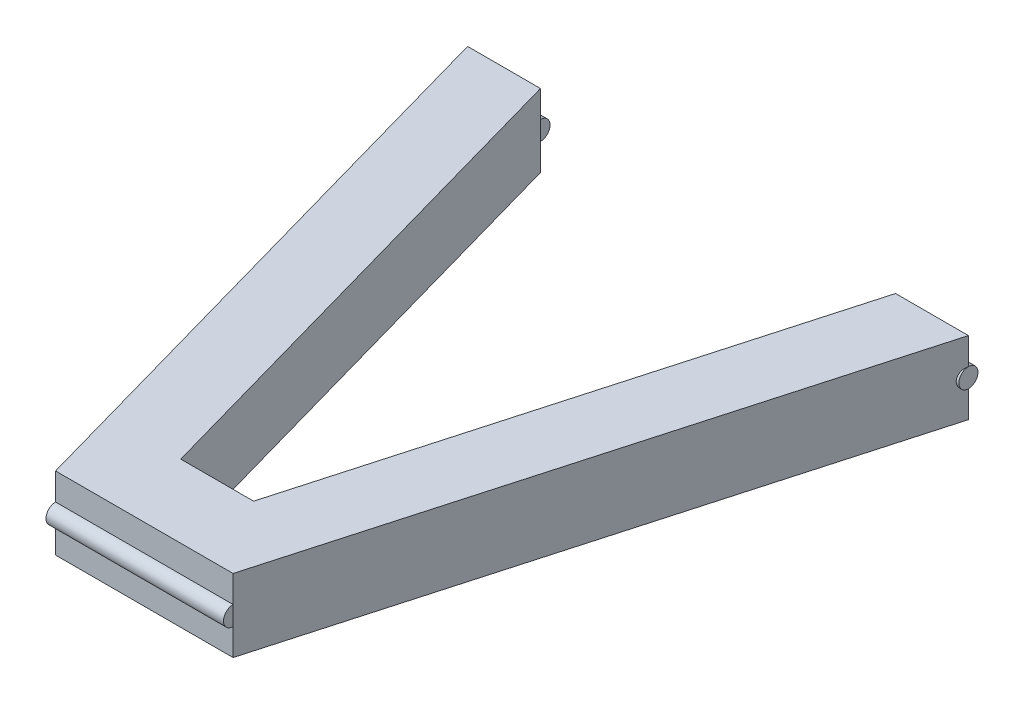
ISO-10303-21;
HEADER;
FILE_DESCRIPTION(('STEP AP214'),'2;1');
FILE_NAME('part.step','',(''),(''),'','','');
FILE_SCHEMA(('AUTOMOTIVE_DESIGN { 1 0 10303 214 1 1 1 1 }'));
ENDSEC;
DATA;
#1=APPLICATION_CONTEXT('core data for automotive mechanical design processes');
#2=APPLICATION_PROTOCOL_DEFINITION('international standard','automotive_design',2000,#1);
#3=PRODUCT_CONTEXT('',#1,'mechanical');
#4=PRODUCT('Part','Part','',(#3));
#5=PRODUCT_RELATED_PRODUCT_CATEGORY('part','',(#4));
#6=PRODUCT_DEFINITION_FORMATION('','',#4);
#7=PRODUCT_DEFINITION_CONTEXT('part definition',#1,'design');
#8=PRODUCT_DEFINITION('design','',#6,#7);
#9=PRODUCT_DEFINITION_SHAPE('','',#8);
#10=(LENGTH_UNIT() NAMED_UNIT(*) SI_UNIT(.MILLI.,.METRE.));
#11=(NAMED_UNIT(*) PLANE_ANGLE_UNIT() SI_UNIT($,.RADIAN.));
#12=(NAMED_UNIT(*) SI_UNIT($,.STERADIAN.) SOLID_ANGLE_UNIT());
#13=UNCERTAINTY_MEASURE_WITH_UNIT(LENGTH_MEASURE(1.E-05),#10,'distance_accuracy_value','');
#14=(GEOMETRIC_REPRESENTATION_CONTEXT(3) GLOBAL_UNCERTAINTY_ASSIGNED_CONTEXT((#13)) GLOBAL_UNIT_ASSIGNED_CONTEXT((#10,
#11,#12)) REPRESENTATION_CONTEXT('',''));
#15=CARTESIAN_POINT('',(0.,0.,0.));
#16=DIRECTION('',(0.,0.,1.));
#17=DIRECTION('',(1.,0.,0.));
#18=AXIS2_PLACEMENT_3D('',#15,#16,#17);
#19=CARTESIAN_POINT('',(261.9,38.1,-300.));
#20=DIRECTION('',(0.,0.,1.));
#21=DIRECTION('',(1.,0.,0.));
#22=AXIS2_PLACEMENT_3D('',#19,#20,#21);
#23=PLANE('',#22);
#24=DIRECTION('',(0.,-1.,0.));
#25=VECTOR('',#24,1.);
#26=CARTESIAN_POINT('',(261.9,38.1,-300.));
#27=LINE('',#26,#25);
#28=CARTESIAN_POINT('',(261.9,38.1,-300.));
#29=VERTEX_POINT('',#28);
#30=CARTESIAN_POINT('',(261.9,24.05,-300.));
#31=VERTEX_POINT('',#30);
#32=EDGE_CURVE('E257',#29,#31,#27,.T.);
#33=ORIENTED_EDGE('',*,*,#32,.T.);
#34=DIRECTION('',(-1.,0.,0.));
#35=VECTOR('',#34,1.);
#36=CARTESIAN_POINT('',(261.9,24.05,-300.));
#37=LINE('',#36,#35);
#38=CARTESIAN_POINT('',(223.8,24.05,-300.));
#39=VERTEX_POINT('',#38);
#40=EDGE_CURVE('E246',#31,#39,#37,.T.);
#41=ORIENTED_EDGE('',*,*,#40,.T.);
#42=DIRECTION('',(0.,-1.,0.));
#43=VECTOR('',#42,1.);
#44=CARTESIAN_POINT('',(223.8,38.1,-300.));
#45=LINE('',#44,#43);
#46=CARTESIAN_POINT('',(223.8,38.1,-300.));
#47=VERTEX_POINT('',#46);
#48=EDGE_CURVE('E239',#47,#39,#45,.T.);
#49=ORIENTED_EDGE('',*,*,#48,.F.);
#50=DIRECTION('',(-1.,0.,0.));
#51=VECTOR('',#50,1.);
#52=CARTESIAN_POINT('',(261.9,38.1,-300.));
#53=LINE('',#52,#51);
#54=EDGE_CURVE('E315',#29,#47,#53,.T.);
#55=ORIENTED_EDGE('',*,*,#54,.F.);
#56=EDGE_LOOP('',(#33,#41,#49,#55));
#57=FACE_BOUND('',#56,.T.);
#58=ADVANCED_FACE('F59',(#57),#23,.F.);
#59=CARTESIAN_POINT('',(38.1,38.1,-300.));
#60=DIRECTION('',(0.,0.,1.));
#61=DIRECTION('',(1.,0.,0.));
#62=AXIS2_PLACEMENT_3D('',#59,#60,#61);
#63=PLANE('',#62);
#64=DIRECTION('',(0.,-1.,0.));
#65=VECTOR('',#64,1.);
#66=CARTESIAN_POINT('',(0.,38.1,-300.));
#67=LINE('',#66,#65);
#68=CARTESIAN_POINT('',(0.,14.05,-300.));
#69=VERTEX_POINT('',#68);
#70=CARTESIAN_POINT('',(0.,0.,-300.));
#71=VERTEX_POINT('',#70);
#72=EDGE_CURVE('E295',#69,#71,#67,.T.);
#73=ORIENTED_EDGE('',*,*,#72,.F.);
#74=DIRECTION('',(1.,0.,0.));
#75=VECTOR('',#74,1.);
#76=CARTESIAN_POINT('',(0.,14.05,-300.));
#77=LINE('',#76,#75);
#78=CARTESIAN_POINT('',(38.1,14.05,-300.));
#79=VERTEX_POINT('',#78);
#80=EDGE_CURVE('E379',#69,#79,#77,.T.);
#81=ORIENTED_EDGE('',*,*,#80,.T.);
#82=DIRECTION('',(0.,-1.,0.));
#83=VECTOR('',#82,1.);
#84=CARTESIAN_POINT('',(38.1,38.1,-300.));
#85=LINE('',#84,#83);
#86=CARTESIAN_POINT('',(38.1,0.,-300.));
#87=VERTEX_POINT('',#86);
#88=EDGE_CURVE('E290',#79,#87,#85,.T.);
#89=ORIENTED_EDGE('',*,*,#88,.T.);
#90=DIRECTION('',(-1.,0.,0.));
#91=VECTOR('',#90,1.);
#92=CARTESIAN_POINT('',(38.1,0.,-300.));
#93=LINE('',#92,#91);
#94=EDGE_CURVE('E324',#87,#71,#93,.T.);
#95=ORIENTED_EDGE('',*,*,#94,.T.);
#96=EDGE_LOOP('',(#73,#81,#89,#95));
#97=FACE_BOUND('',#96,.T.);
#98=ADVANCED_FACE('F412',(#97),#63,.F.);
#99=CARTESIAN_POINT('',(150.,38.1,0.));
#100=DIRECTION('',(0.,0.,-1.));
#101=DIRECTION('',(-1.,0.,0.));
#102=AXIS2_PLACEMENT_3D('',#99,#100,#101);
#103=PLANE('',#102);
#104=DIRECTION('',(0.,-1.,0.));
#105=VECTOR('',#104,1.);
#106=CARTESIAN_POINT('',(84.5360824742268,38.1,0.));
#107=LINE('',#106,#105);
#108=CARTESIAN_POINT('',(84.5360824742268,38.1,0.));
#109=VERTEX_POINT('',#108);
#110=CARTESIAN_POINT('',(84.5360824742268,24.05,0.));
#111=VERTEX_POINT('',#110);
#112=EDGE_CURVE('E296',#109,#111,#107,.T.);
#113=ORIENTED_EDGE('',*,*,#112,.T.);
#114=DIRECTION('',(1.,0.,0.));
#115=VECTOR('',#114,1.);
#116=CARTESIAN_POINT('',(84.5360824742268,24.05,0.));
#117=LINE('',#116,#115);
#118=CARTESIAN_POINT('',(177.363917525773,24.05,0.));
#119=VERTEX_POINT('',#118);
#120=EDGE_CURVE('E342',#111,#119,#117,.T.);
#121=ORIENTED_EDGE('',*,*,#120,.T.);
#122=DIRECTION('',(0.,-1.,0.));
#123=VECTOR('',#122,1.);
#124=CARTESIAN_POINT('',(177.363917525773,38.1,0.));
#125=LINE('',#124,#123);
#126=CARTESIAN_POINT('',(177.363917525773,38.1,0.));
#127=VERTEX_POINT('',#126);
#128=EDGE_CURVE('E302',#127,#119,#125,.T.);
#129=ORIENTED_EDGE('',*,*,#128,.F.);
#130=DIRECTION('',(1.,0.,0.));
#131=VECTOR('',#130,1.);
#132=CARTESIAN_POINT('',(111.9,38.1,0.));
#133=LINE('',#132,#131);
#134=EDGE_CURVE('E346',#109,#127,#133,.T.);
#135=ORIENTED_EDGE('',*,*,#134,.F.);
#136=EDGE_LOOP('',(#113,#121,#129,#135));
#137=FACE_BOUND('',#136,.T.);
#138=ADVANCED_FACE('F418',(#137),#103,.F.);
#139=CARTESIAN_POINT('',(223.8,14.05,-300.));
#140=VERTEX_POINT('',#139);
#141=CARTESIAN_POINT('',(223.8,0.,-300.));
#142=VERTEX_POINT('',#141);
#143=EDGE_CURVE('E240',#140,#142,#45,.T.);
#144=ORIENTED_EDGE('',*,*,#143,.F.);
#145=DIRECTION('',(-1.,0.,0.));
#146=VECTOR('',#145,1.);
#147=CARTESIAN_POINT('',(261.9,14.05,-300.));
#148=LINE('',#147,#146);
#149=CARTESIAN_POINT('',(261.9,14.05,-300.));
#150=VERTEX_POINT('',#149);
#151=EDGE_CURVE('E249',#140,#150,#148,.F.);
#152=ORIENTED_EDGE('',*,*,#151,.T.);
#153=CARTESIAN_POINT('',(261.9,0.,-300.));
#154=VERTEX_POINT('',#153);
#155=EDGE_CURVE('E310',#150,#154,#27,.T.);
#156=ORIENTED_EDGE('',*,*,#155,.T.);
#157=DIRECTION('',(-1.,0.,0.));
#158=VECTOR('',#157,1.);
#159=CARTESIAN_POINT('',(261.9,0.,-300.));
#160=LINE('',#159,#158);
#161=EDGE_CURVE('E338',#154,#142,#160,.T.);
#162=ORIENTED_EDGE('',*,*,#161,.T.);
#163=EDGE_LOOP('',(#144,#152,#156,#162));
#164=FACE_BOUND('',#163,.T.);
#165=ADVANCED_FACE('F414',(#164),#23,.F.);
#166=CARTESIAN_POINT('',(223.8,38.1,-300.));
#167=DIRECTION('',(0.962516121741574,0.,0.271224474167728));
#168=DIRECTION('',(0.271224474167728,0.,-0.962516121741574));
#169=AXIS2_PLACEMENT_3D('',#166,#167,#168);
#170=PLANE('',#169);
#171=DIRECTION('',(-0.271224474167728,0.,0.962516121741573));
#172=VECTOR('',#171,1.);
#173=CARTESIAN_POINT('',(223.8,0.,-300.));
#174=LINE('',#173,#172);
#175=CARTESIAN_POINT('',(150.,0.,-38.1));
#176=VERTEX_POINT('',#175);
#177=EDGE_CURVE('E335',#142,#176,#174,.T.);
#178=ORIENTED_EDGE('',*,*,#177,.T.);
#179=DIRECTION('',(0.,-1.,0.));
#180=VECTOR('',#179,1.);
#181=CARTESIAN_POINT('',(150.,38.1,-38.1));
#182=LINE('',#181,#180);
#183=CARTESIAN_POINT('',(150.,38.1,-38.1));
#184=VERTEX_POINT('',#183);
#185=EDGE_CURVE('E273',#184,#176,#182,.T.);
#186=ORIENTED_EDGE('',*,*,#185,.F.);
#187=DIRECTION('',(-0.271224474167728,0.,0.962516121741573));
#188=VECTOR('',#187,1.);
#189=CARTESIAN_POINT('',(223.8,38.1,-300.));
#190=LINE('',#189,#188);
#191=EDGE_CURVE('E263',#47,#184,#190,.T.);
#192=ORIENTED_EDGE('',*,*,#191,.F.);
#193=ORIENTED_EDGE('',*,*,#48,.T.);
#194=EDGE_CURVE('E231',#39,#140,#45,.T.);
#195=ORIENTED_EDGE('',*,*,#194,.T.);
#196=ORIENTED_EDGE('',*,*,#143,.T.);
#197=EDGE_LOOP('',(#178,#186,#192,#193,#195,#196));
#198=FACE_BOUND('',#197,.T.);
#199=ADVANCED_FACE('F261',(#198),#170,.F.);
#200=CARTESIAN_POINT('',(111.9,38.1,-38.1));
#201=DIRECTION('',(0.,0.,1.));
#202=DIRECTION('',(1.,0.,0.));
#203=AXIS2_PLACEMENT_3D('',#200,#201,#202);
#204=PLANE('',#203);
#205=DIRECTION('',(-1.,0.,0.));
#206=VECTOR('',#205,1.);
#207=CARTESIAN_POINT('',(111.9,0.,-38.1));
#208=LINE('',#207,#206);
#209=CARTESIAN_POINT('',(111.9,0.,-38.1));
#210=VERTEX_POINT('',#209);
#211=EDGE_CURVE('E332',#176,#210,#208,.T.);
#212=ORIENTED_EDGE('',*,*,#211,.T.);
#213=DIRECTION('',(0.,-1.,0.));
#214=VECTOR('',#213,1.);
#215=CARTESIAN_POINT('',(111.9,38.1,-38.1));
#216=LINE('',#215,#214);
#217=CARTESIAN_POINT('',(111.9,38.1,-38.1));
#218=VERTEX_POINT('',#217);
#219=EDGE_CURVE('E277',#218,#210,#216,.T.);
#220=ORIENTED_EDGE('',*,*,#219,.F.);
#221=DIRECTION('',(-1.,0.,0.));
#222=VECTOR('',#221,1.);
#223=CARTESIAN_POINT('',(111.9,38.1,-38.1));
#224=LINE('',#223,#222);
#225=EDGE_CURVE('E358',#184,#218,#224,.T.);
#226=ORIENTED_EDGE('',*,*,#225,.F.);
#227=ORIENTED_EDGE('',*,*,#185,.T.);
#228=EDGE_LOOP('',(#212,#220,#226,#227));
#229=FACE_BOUND('',#228,.T.);
#230=ADVANCED_FACE('F430',(#229),#204,.F.);
#231=CARTESIAN_POINT('',(38.1,38.1,-300.));
#232=DIRECTION('',(-0.962516121741573,0.,0.271224474167729));
#233=DIRECTION('',(0.271224474167729,0.,0.962516121741573));
#234=AXIS2_PLACEMENT_3D('',#231,#232,#233);
#235=PLANE('',#234);
#236=DIRECTION('',(-0.271224474167729,0.,-0.962516121741573));
#237=VECTOR('',#236,1.);
#238=CARTESIAN_POINT('',(38.1,0.,-300.));
#239=LINE('',#238,#237);
#240=EDGE_CURVE('E328',#210,#87,#239,.T.);
#241=ORIENTED_EDGE('',*,*,#240,.T.);
#242=ORIENTED_EDGE('',*,*,#88,.F.);
#243=CARTESIAN_POINT('',(38.1,24.05,-300.));
#244=VERTEX_POINT('',#243);
#245=EDGE_CURVE('E289',#244,#79,#85,.T.);
#246=ORIENTED_EDGE('',*,*,#245,.F.);
#247=CARTESIAN_POINT('',(38.1,38.1,-300.));
#248=VERTEX_POINT('',#247);
#249=EDGE_CURVE('E283',#248,#244,#85,.T.);
#250=ORIENTED_EDGE('',*,*,#249,.F.);
#251=DIRECTION('',(-0.271224474167729,0.,-0.962516121741573));
#252=VECTOR('',#251,1.);
#253=CARTESIAN_POINT('',(38.1,38.1,-300.));
#254=LINE('',#253,#252);
#255=EDGE_CURVE('E355',#218,#248,#254,.T.);
#256=ORIENTED_EDGE('',*,*,#255,.F.);
#257=ORIENTED_EDGE('',*,*,#219,.T.);
#258=EDGE_LOOP('',(#241,#242,#246,#250,#256,#257));
#259=FACE_BOUND('',#258,.T.);
#260=ADVANCED_FACE('F792',(#259),#235,.F.);
#261=ORIENTED_EDGE('',*,*,#249,.T.);
#262=DIRECTION('',(1.,0.,0.));
#263=VECTOR('',#262,1.);
#264=CARTESIAN_POINT('',(0.,24.05,-300.));
#265=LINE('',#264,#263);
#266=CARTESIAN_POINT('',(0.,24.05,-300.));
#267=VERTEX_POINT('',#266);
#268=EDGE_CURVE('E383',#244,#267,#265,.F.);
#269=ORIENTED_EDGE('',*,*,#268,.T.);
#270=CARTESIAN_POINT('',(0.,38.1,-300.));
#271=VERTEX_POINT('',#270);
#272=EDGE_CURVE('E291',#271,#267,#67,.T.);
#273=ORIENTED_EDGE('',*,*,#272,.F.);
#274=DIRECTION('',(-1.,0.,0.));
#275=VECTOR('',#274,1.);
#276=CARTESIAN_POINT('',(38.1,38.1,-300.));
#277=LINE('',#276,#275);
#278=EDGE_CURVE('E352',#248,#271,#277,.T.);
#279=ORIENTED_EDGE('',*,*,#278,.F.);
#280=EDGE_LOOP('',(#261,#269,#273,#279));
#281=FACE_BOUND('',#280,.T.);
#282=ADVANCED_FACE('F421',(#281),#63,.F.);
#283=CARTESIAN_POINT('',(0.,38.1,-300.));
#284=DIRECTION('',(0.962516121741573,0.,-0.271224474167729));
#285=DIRECTION('',(-0.271224474167729,0.,-0.962516121741573));
#286=AXIS2_PLACEMENT_3D('',#283,#284,#285);
#287=PLANE('',#286);
#288=ORIENTED_EDGE('',*,*,#272,.T.);
#289=CARTESIAN_POINT('',(0.,19.05,-300.));
#290=DIRECTION('',(0.962516121741573,0.,-0.271224474167729));
#291=DIRECTION('',(0.271224474167729,0.,0.962516121741573));
#292=AXIS2_PLACEMENT_3D('',#289,#290,#291);
#293=ELLIPSE('',#292,5.19471818399574,5.);
#294=EDGE_CURVE('E266',#267,#69,#293,.T.);
#295=ORIENTED_EDGE('',*,*,#294,.T.);
#296=ORIENTED_EDGE('',*,*,#72,.T.);
#297=DIRECTION('',(0.271224474167729,0.,0.962516121741573));
#298=VECTOR('',#297,1.);
#299=CARTESIAN_POINT('',(0.,0.,-300.));
#300=LINE('',#299,#298);
#301=CARTESIAN_POINT('',(84.5360824742268,0.,0.));
#302=VERTEX_POINT('',#301);
#303=EDGE_CURVE('E320',#71,#302,#300,.T.);
#304=ORIENTED_EDGE('',*,*,#303,.T.);
#305=CARTESIAN_POINT('',(84.5360824742268,14.05,0.));
#306=VERTEX_POINT('',#305);
#307=EDGE_CURVE('E301',#306,#302,#107,.T.);
#308=ORIENTED_EDGE('',*,*,#307,.F.);
#309=EDGE_CURVE('E300',#111,#306,#107,.T.);
#310=ORIENTED_EDGE('',*,*,#309,.F.);
#311=ORIENTED_EDGE('',*,*,#112,.F.);
#312=DIRECTION('',(0.271224474167729,0.,0.962516121741573));
#313=VECTOR('',#312,1.);
#314=CARTESIAN_POINT('',(0.,38.1,-300.));
#315=LINE('',#314,#313);
#316=EDGE_CURVE('E349',#271,#109,#315,.T.);
#317=ORIENTED_EDGE('',*,*,#316,.F.);
#318=EDGE_LOOP('',(#288,#295,#296,#304,#308,#310,#311,#317));
#319=FACE_BOUND('',#318,.T.);
#320=ADVANCED_FACE('F758',(#319),#287,.F.);
#321=CARTESIAN_POINT('',(177.363917525773,14.05,0.));
#322=VERTEX_POINT('',#321);
#323=CARTESIAN_POINT('',(177.363917525773,0.,0.));
#324=VERTEX_POINT('',#323);
#325=EDGE_CURVE('E307',#322,#324,#125,.T.);
#326=ORIENTED_EDGE('',*,*,#325,.F.);
#327=DIRECTION('',(1.,0.,0.));
#328=VECTOR('',#327,1.);
#329=CARTESIAN_POINT('',(84.5360824742268,14.05,0.));
#330=LINE('',#329,#328);
#331=EDGE_CURVE('E368',#322,#306,#330,.F.);
#332=ORIENTED_EDGE('',*,*,#331,.T.);
#333=ORIENTED_EDGE('',*,*,#307,.T.);
#334=DIRECTION('',(1.,0.,0.));
#335=VECTOR('',#334,1.);
#336=CARTESIAN_POINT('',(150.,0.,0.));
#337=LINE('',#336,#335);
#338=EDGE_CURVE('E316',#302,#324,#337,.T.);
#339=ORIENTED_EDGE('',*,*,#338,.T.);
#340=EDGE_LOOP('',(#326,#332,#333,#339));
#341=FACE_BOUND('',#340,.T.);
#342=ADVANCED_FACE('F433',(#341),#103,.F.);
#343=CARTESIAN_POINT('',(261.9,38.1,-300.));
#344=DIRECTION('',(-0.962516121741573,0.,-0.271224474167728));
#345=DIRECTION('',(-0.271224474167728,0.,0.962516121741574));
#346=AXIS2_PLACEMENT_3D('',#343,#344,#345);
#347=PLANE('',#346);
#348=ORIENTED_EDGE('',*,*,#155,.F.);
#349=CARTESIAN_POINT('',(261.9,19.05,-300.));
#350=DIRECTION('',(-0.962516121741573,0.,-0.271224474167728));
#351=DIRECTION('',(-0.271224474167728,0.,0.962516121741574));
#352=AXIS2_PLACEMENT_3D('',#349,#350,#351);
#353=ELLIPSE('',#352,5.19471818399574,5.);
#354=EDGE_CURVE('E269',#150,#31,#353,.T.);
#355=ORIENTED_EDGE('',*,*,#354,.T.);
#356=ORIENTED_EDGE('',*,*,#32,.F.);
#357=DIRECTION('',(0.271224474167728,0.,-0.962516121741573));
#358=VECTOR('',#357,1.);
#359=CARTESIAN_POINT('',(261.9,38.1,-300.));
#360=LINE('',#359,#358);
#361=EDGE_CURVE('E343',#127,#29,#360,.T.);
#362=ORIENTED_EDGE('',*,*,#361,.F.);
#363=ORIENTED_EDGE('',*,*,#128,.T.);
#364=EDGE_CURVE('E306',#119,#322,#125,.T.);
#365=ORIENTED_EDGE('',*,*,#364,.T.);
#366=ORIENTED_EDGE('',*,*,#325,.T.);
#367=DIRECTION('',(0.271224474167728,0.,-0.962516121741573));
#368=VECTOR('',#367,1.);
#369=CARTESIAN_POINT('',(261.9,0.,-300.));
#370=LINE('',#369,#368);
#371=EDGE_CURVE('E311',#324,#154,#370,.T.);
#372=ORIENTED_EDGE('',*,*,#371,.T.);
#373=EDGE_LOOP('',(#348,#355,#356,#362,#363,#365,#366,#372));
#374=FACE_BOUND('',#373,.T.);
#375=ADVANCED_FACE('F450',(#374),#347,.F.);
#376=CARTESIAN_POINT('',(0.,38.1,0.));
#377=DIRECTION('',(0.,1.,0.));
#378=DIRECTION('',(0.,0.,1.));
#379=AXIS2_PLACEMENT_3D('',#376,#377,#378);
#380=PLANE('',#379);
#381=ORIENTED_EDGE('',*,*,#54,.T.);
#382=ORIENTED_EDGE('',*,*,#191,.T.);
#383=ORIENTED_EDGE('',*,*,#225,.T.);
#384=ORIENTED_EDGE('',*,*,#255,.T.);
#385=ORIENTED_EDGE('',*,*,#278,.T.);
#386=ORIENTED_EDGE('',*,*,#316,.T.);
#387=ORIENTED_EDGE('',*,*,#134,.T.);
#388=ORIENTED_EDGE('',*,*,#361,.T.);
#389=EDGE_LOOP('',(#381,#382,#383,#384,#385,#386,#387,#388));
#390=FACE_BOUND('',#389,.T.);
#391=ADVANCED_FACE('F444',(#390),#380,.T.);
#392=CARTESIAN_POINT('',(0.,0.,0.));
#393=DIRECTION('',(0.,1.,0.));
#394=DIRECTION('',(0.,0.,1.));
#395=AXIS2_PLACEMENT_3D('',#392,#393,#394);
#396=PLANE('',#395);
#397=ORIENTED_EDGE('',*,*,#161,.F.);
#398=ORIENTED_EDGE('',*,*,#371,.F.);
#399=ORIENTED_EDGE('',*,*,#338,.F.);
#400=ORIENTED_EDGE('',*,*,#303,.F.);
#401=ORIENTED_EDGE('',*,*,#94,.F.);
#402=ORIENTED_EDGE('',*,*,#240,.F.);
#403=ORIENTED_EDGE('',*,*,#211,.F.);
#404=ORIENTED_EDGE('',*,*,#177,.F.);
#405=EDGE_LOOP('',(#397,#398,#399,#400,#401,#402,#403,#404));
#406=FACE_BOUND('',#405,.T.);
#407=ADVANCED_FACE('F438',(#406),#396,.F.);
#408=CARTESIAN_POINT('',(84.5360824742268,19.05,0.));
#409=DIRECTION('',(1.,0.,0.));
#410=DIRECTION('',(0.,0.,-1.));
#411=AXIS2_PLACEMENT_3D('',#408,#409,#410);
#412=PLANE('',#411);
#413=CARTESIAN_POINT('',(84.5360824742268,19.05,0.));
#414=DIRECTION('',(1.,0.,0.));
#415=DIRECTION('',(0.,0.,-1.));
#416=AXIS2_PLACEMENT_3D('',#413,#414,#415);
#417=CIRCLE('',#416,5.);
#418=EDGE_CURVE('E375',#111,#306,#417,.T.);
#419=ORIENTED_EDGE('',*,*,#418,.F.);
#420=ORIENTED_EDGE('',*,*,#309,.T.);
#421=EDGE_LOOP('',(#419,#420));
#422=FACE_BOUND('',#421,.T.);
#423=ADVANCED_FACE('F728',(#422),#412,.F.);
#424=CARTESIAN_POINT('',(177.363917525773,19.05,0.));
#425=DIRECTION('',(1.,0.,0.));
#426=DIRECTION('',(0.,0.,-1.));
#427=AXIS2_PLACEMENT_3D('',#424,#425,#426);
#428=PLANE('',#427);
#429=ORIENTED_EDGE('',*,*,#364,.F.);
#430=CARTESIAN_POINT('',(177.363917525773,19.05,0.));
#431=DIRECTION('',(1.,0.,0.));
#432=DIRECTION('',(0.,0.,-1.));
#433=AXIS2_PLACEMENT_3D('',#430,#431,#432);
#434=CIRCLE('',#433,5.);
#435=EDGE_CURVE('E372',#119,#322,#434,.T.);
#436=ORIENTED_EDGE('',*,*,#435,.T.);
#437=EDGE_LOOP('',(#429,#436));
#438=FACE_BOUND('',#437,.T.);
#439=ADVANCED_FACE('F719',(#438),#428,.T.);
#440=CARTESIAN_POINT('',(84.5360824742268,19.05,0.));
#441=DIRECTION('',(1.,0.,0.));
#442=DIRECTION('',(0.,0.,-1.));
#443=AXIS2_PLACEMENT_3D('',#440,#441,#442);
#444=CYLINDRICAL_SURFACE('',#443,5.);
#445=ORIENTED_EDGE('',*,*,#120,.F.);
#446=ORIENTED_EDGE('',*,*,#418,.T.);
#447=ORIENTED_EDGE('',*,*,#331,.F.);
#448=ORIENTED_EDGE('',*,*,#435,.F.);
#449=EDGE_LOOP('',(#445,#446,#447,#448));
#450=FACE_BOUND('',#449,.T.);
#451=ADVANCED_FACE('F703',(#450),#444,.T.);
#452=CARTESIAN_POINT('',(38.1,19.05,-300.));
#453=DIRECTION('',(1.,0.,0.));
#454=DIRECTION('',(0.,0.,-1.));
#455=AXIS2_PLACEMENT_3D('',#452,#453,#454);
#456=PLANE('',#455);
#457=ORIENTED_EDGE('',*,*,#245,.T.);
#458=CARTESIAN_POINT('',(38.1,19.05,-300.));
#459=DIRECTION('',(1.,0.,0.));
#460=DIRECTION('',(0.,0.,-1.));
#461=AXIS2_PLACEMENT_3D('',#458,#459,#460);
#462=CIRCLE('',#461,5.);
#463=EDGE_CURVE('E387',#79,#244,#462,.T.);
#464=ORIENTED_EDGE('',*,*,#463,.T.);
#465=EDGE_LOOP('',(#457,#464));
#466=FACE_BOUND('',#465,.T.);
#467=ADVANCED_FACE('F694',(#466),#456,.T.);
#468=CARTESIAN_POINT('',(0.,19.05,-300.));
#469=DIRECTION('',(1.,0.,0.));
#470=DIRECTION('',(0.,0.,-1.));
#471=AXIS2_PLACEMENT_3D('',#468,#469,#470);
#472=PLANE('',#471);
#473=CARTESIAN_POINT('',(0.,19.05,-300.));
#474=DIRECTION('',(1.,0.,0.));
#475=DIRECTION('',(0.,0.,-1.));
#476=AXIS2_PLACEMENT_3D('',#473,#474,#475);
#477=CIRCLE('',#476,5.);
#478=EDGE_CURVE('E150',#267,#69,#477,.T.);
#479=ORIENTED_EDGE('',*,*,#478,.F.);
#480=EDGE_CURVE('E259',#69,#267,#477,.T.);
#481=ORIENTED_EDGE('',*,*,#480,.F.);
#482=EDGE_LOOP('',(#479,#481));
#483=FACE_BOUND('',#482,.T.);
#484=ADVANCED_FACE('F686',(#483),#472,.F.);
#485=CARTESIAN_POINT('',(0.,19.05,-300.));
#486=DIRECTION('',(1.,0.,0.));
#487=DIRECTION('',(0.,0.,-1.));
#488=AXIS2_PLACEMENT_3D('',#485,#486,#487);
#489=CYLINDRICAL_SURFACE('',#488,5.);
#490=ORIENTED_EDGE('',*,*,#80,.F.);
#491=ORIENTED_EDGE('',*,*,#480,.T.);
#492=ORIENTED_EDGE('',*,*,#268,.F.);
#493=ORIENTED_EDGE('',*,*,#463,.F.);
#494=EDGE_LOOP('',(#490,#491,#492,#493));
#495=FACE_BOUND('',#494,.T.);
#496=ADVANCED_FACE('F679',(#495),#489,.T.);
#497=ORIENTED_EDGE('',*,*,#294,.F.);
#498=ORIENTED_EDGE('',*,*,#478,.T.);
#499=EDGE_LOOP('',(#497,#498));
#500=FACE_BOUND('',#499,.T.);
#501=ADVANCED_FACE('F408',(#500),#489,.T.);
#502=CARTESIAN_POINT('',(223.8,19.05,-300.));
#503=DIRECTION('',(-1.,0.,0.));
#504=DIRECTION('',(0.,0.,1.));
#505=AXIS2_PLACEMENT_3D('',#502,#503,#504);
#506=PLANE('',#505);
#507=ORIENTED_EDGE('',*,*,#194,.F.);
#508=CARTESIAN_POINT('',(223.8,19.05,-300.));
#509=DIRECTION('',(-1.,0.,0.));
#510=DIRECTION('',(0.,0.,1.));
#511=AXIS2_PLACEMENT_3D('',#508,#509,#510);
#512=CIRCLE('',#511,5.);
#513=EDGE_CURVE('E234',#39,#140,#512,.T.);
#514=ORIENTED_EDGE('',*,*,#513,.T.);
#515=EDGE_LOOP('',(#507,#514));
#516=FACE_BOUND('',#515,.T.);
#517=ADVANCED_FACE('F233',(#516),#506,.T.);
#518=CARTESIAN_POINT('',(261.9,19.05,-300.));
#519=DIRECTION('',(-1.,0.,0.));
#520=DIRECTION('',(0.,0.,1.));
#521=AXIS2_PLACEMENT_3D('',#518,#519,#520);
#522=PLANE('',#521);
#523=CARTESIAN_POINT('',(261.9,19.05,-300.));
#524=DIRECTION('',(-1.,0.,0.));
#525=DIRECTION('',(0.,0.,1.));
#526=AXIS2_PLACEMENT_3D('',#523,#524,#525);
#527=CIRCLE('',#526,5.);
#528=EDGE_CURVE('E396',#150,#31,#527,.T.);
#529=ORIENTED_EDGE('',*,*,#528,.F.);
#530=EDGE_CURVE('E143',#31,#150,#527,.T.);
#531=ORIENTED_EDGE('',*,*,#530,.F.);
#532=EDGE_LOOP('',(#529,#531));
#533=FACE_BOUND('',#532,.T.);
#534=ADVANCED_FACE('F400',(#533),#522,.F.);
#535=CARTESIAN_POINT('',(261.9,19.05,-300.));
#536=DIRECTION('',(-1.,0.,0.));
#537=DIRECTION('',(0.,0.,1.));
#538=AXIS2_PLACEMENT_3D('',#535,#536,#537);
#539=CYLINDRICAL_SURFACE('',#538,5.);
#540=ORIENTED_EDGE('',*,*,#40,.F.);
#541=ORIENTED_EDGE('',*,*,#530,.T.);
#542=ORIENTED_EDGE('',*,*,#151,.F.);
#543=ORIENTED_EDGE('',*,*,#513,.F.);
#544=EDGE_LOOP('',(#540,#541,#542,#543));
#545=FACE_BOUND('',#544,.T.);
#546=ADVANCED_FACE('F245',(#545),#539,.T.);
#547=ORIENTED_EDGE('',*,*,#354,.F.);
#548=ORIENTED_EDGE('',*,*,#528,.T.);
#549=EDGE_LOOP('',(#547,#548));
#550=FACE_BOUND('',#549,.T.);
#551=ADVANCED_FACE('F399',(#550),#539,.T.);
#552=CLOSED_SHELL('',(#58,#98,#138,#165,#199,#230,#260,#282,#320,#342,#375,#391,#407,#423,#439,
#451,#467,#484,#496,#501,#517,#534,#546,#551));
#553=CARTESIAN_POINT('',(261.9,38.1,-295.));
#554=DIRECTION('',(0.,0.,1.));
#555=DIRECTION('',(1.,0.,0.));
#556=AXIS2_PLACEMENT_3D('',#553,#554,#555);
#557=PLANE('',#556);
#558=DIRECTION('',(-1.,0.,0.));
#559=VECTOR('',#558,1.);
#560=CARTESIAN_POINT('',(261.9,5.,-295.));
#561=LINE('',#560,#559);
#562=CARTESIAN_POINT('',(255.2963471081,5.,-295.));
#563=VERTEX_POINT('',#562);
#564=CARTESIAN_POINT('',(227.585783476092,5.,-295.));
#565=VERTEX_POINT('',#564);
#566=EDGE_CURVE('E63',#563,#565,#561,.T.);
#567=ORIENTED_EDGE('',*,*,#566,.F.);
#568=DIRECTION('',(0.,-1.,0.));
#569=VECTOR('',#568,1.);
#570=CARTESIAN_POINT('',(255.2963471081,38.1,-295.));
#571=LINE('',#570,#569);
#572=CARTESIAN_POINT('',(255.2963471081,19.05,-295.));
#573=VERTEX_POINT('',#572);
#574=EDGE_CURVE('E136',#573,#563,#571,.T.);
#575=ORIENTED_EDGE('',*,*,#574,.F.);
#576=DIRECTION('',(0.,-1.,0.));
#577=VECTOR('',#576,1.);
#578=CARTESIAN_POINT('',(255.2963471081,38.1,-295.));
#579=LINE('',#578,#577);
#580=CARTESIAN_POINT('',(255.2963471081,33.1,-295.));
#581=VERTEX_POINT('',#580);
#582=EDGE_CURVE('E454',#581,#573,#579,.T.);
#583=ORIENTED_EDGE('',*,*,#582,.F.);
#584=DIRECTION('',(-1.,0.,0.));
#585=VECTOR('',#584,1.);
#586=CARTESIAN_POINT('',(261.9,33.1,-295.));
#587=LINE('',#586,#585);
#588=CARTESIAN_POINT('',(227.585783476092,33.1,-295.));
#589=VERTEX_POINT('',#588);
#590=EDGE_CURVE('E473',#581,#589,#587,.T.);
#591=ORIENTED_EDGE('',*,*,#590,.T.);
#592=DIRECTION('',(0.,-1.,0.));
#593=VECTOR('',#592,1.);
#594=CARTESIAN_POINT('',(227.585783476092,38.1,-295.));
#595=LINE('',#594,#593);
#596=EDGE_CURVE('E521',#589,#565,#595,.T.);
#597=ORIENTED_EDGE('',*,*,#596,.T.);
#598=EDGE_LOOP('',(#567,#575,#583,#591,#597));
#599=FACE_BOUND('',#598,.T.);
#600=ADVANCED_FACE('F532',(#599),#557,.T.);
#601=CARTESIAN_POINT('',(228.612580608708,38.1,-298.643877629161));
#602=DIRECTION('',(0.962516121741574,0.,0.271224474167728));
#603=DIRECTION('',(0.271224474167728,0.,-0.962516121741574));
#604=AXIS2_PLACEMENT_3D('',#601,#602,#603);
#605=PLANE('',#604);
#606=DIRECTION('',(-0.271224474167728,0.,0.962516121741574));
#607=VECTOR('',#606,1.);
#608=CARTESIAN_POINT('',(228.612580608708,5.,-298.643877629161));
#609=LINE('',#608,#607);
#610=CARTESIAN_POINT('',(153.785783476092,5.,-33.1));
#611=VERTEX_POINT('',#610);
#612=EDGE_CURVE('E132',#565,#611,#609,.T.);
#613=ORIENTED_EDGE('',*,*,#612,.F.);
#614=ORIENTED_EDGE('',*,*,#596,.F.);
#615=DIRECTION('',(-0.271224474167728,0.,0.962516121741574));
#616=VECTOR('',#615,1.);
#617=CARTESIAN_POINT('',(228.612580608708,33.1,-298.643877629161));
#618=LINE('',#617,#616);
#619=CARTESIAN_POINT('',(153.785783476092,33.1,-33.1));
#620=VERTEX_POINT('',#619);
#621=EDGE_CURVE('E470',#589,#620,#618,.T.);
#622=ORIENTED_EDGE('',*,*,#621,.T.);
#623=DIRECTION('',(0.,-1.,0.));
#624=VECTOR('',#623,1.);
#625=CARTESIAN_POINT('',(153.785783476092,38.1,-33.1000000000001));
#626=LINE('',#625,#624);
#627=EDGE_CURVE('E515',#620,#611,#626,.T.);
#628=ORIENTED_EDGE('',*,*,#627,.T.);
#629=EDGE_LOOP('',(#613,#614,#622,#628));
#630=FACE_BOUND('',#629,.T.);
#631=ADVANCED_FACE('F541',(#630),#605,.T.);
#632=CARTESIAN_POINT('',(111.9,38.1,-33.1));
#633=DIRECTION('',(0.,0.,1.));
#634=DIRECTION('',(1.,0.,0.));
#635=AXIS2_PLACEMENT_3D('',#632,#633,#634);
#636=PLANE('',#635);
#637=DIRECTION('',(-1.,0.,0.));
#638=VECTOR('',#637,1.);
#639=CARTESIAN_POINT('',(111.9,5.,-33.1));
#640=LINE('',#639,#638);
#641=CARTESIAN_POINT('',(108.114216523908,5.,-33.1));
#642=VERTEX_POINT('',#641);
#643=EDGE_CURVE('E518',#611,#642,#640,.T.);
#644=ORIENTED_EDGE('',*,*,#643,.F.);
#645=ORIENTED_EDGE('',*,*,#627,.F.);
#646=DIRECTION('',(-1.,0.,0.));
#647=VECTOR('',#646,1.);
#648=CARTESIAN_POINT('',(111.9,33.1,-33.1));
#649=LINE('',#648,#647);
#650=CARTESIAN_POINT('',(108.114216523908,33.1,-33.1));
#651=VERTEX_POINT('',#650);
#652=EDGE_CURVE('E467',#620,#651,#649,.T.);
#653=ORIENTED_EDGE('',*,*,#652,.T.);
#654=DIRECTION('',(0.,-1.,0.));
#655=VECTOR('',#654,1.);
#656=CARTESIAN_POINT('',(108.114216523908,38.1,-33.1));
#657=LINE('',#656,#655);
#658=EDGE_CURVE('E507',#651,#642,#657,.T.);
#659=ORIENTED_EDGE('',*,*,#658,.T.);
#660=EDGE_LOOP('',(#644,#645,#653,#659));
#661=FACE_BOUND('',#660,.T.);
#662=ADVANCED_FACE('F544',(#661),#636,.T.);
#663=CARTESIAN_POINT('',(33.2874193912921,38.1,-298.643877629161));
#664=DIRECTION('',(-0.962516121741573,0.,0.271224474167729));
#665=DIRECTION('',(0.271224474167729,0.,0.962516121741573));
#666=AXIS2_PLACEMENT_3D('',#663,#664,#665);
#667=PLANE('',#666);
#668=DIRECTION('',(-0.271224474167729,0.,-0.962516121741573));
#669=VECTOR('',#668,1.);
#670=CARTESIAN_POINT('',(33.2874193912921,5.,-298.643877629161));
#671=LINE('',#670,#669);
#672=CARTESIAN_POINT('',(34.3142165239081,5.,-295.));
#673=VERTEX_POINT('',#672);
#674=EDGE_CURVE('E511',#642,#673,#671,.T.);
#675=ORIENTED_EDGE('',*,*,#674,.F.);
#676=ORIENTED_EDGE('',*,*,#658,.F.);
#677=DIRECTION('',(-0.271224474167729,0.,-0.962516121741573));
#678=VECTOR('',#677,1.);
#679=CARTESIAN_POINT('',(33.2874193912921,33.1,-298.643877629161));
#680=LINE('',#679,#678);
#681=CARTESIAN_POINT('',(34.3142165239081,33.1,-295.));
#682=VERTEX_POINT('',#681);
#683=EDGE_CURVE('E464',#651,#682,#680,.T.);
#684=ORIENTED_EDGE('',*,*,#683,.T.);
#685=DIRECTION('',(0.,-1.,0.));
#686=VECTOR('',#685,1.);
#687=CARTESIAN_POINT('',(34.3142165239081,38.1,-295.));
#688=LINE('',#687,#686);
#689=EDGE_CURVE('E504',#682,#673,#688,.T.);
#690=ORIENTED_EDGE('',*,*,#689,.T.);
#691=EDGE_LOOP('',(#675,#676,#684,#690));
#692=FACE_BOUND('',#691,.T.);
#693=ADVANCED_FACE('F563',(#692),#667,.T.);
#694=CARTESIAN_POINT('',(38.1,38.1,-295.));
#695=DIRECTION('',(0.,0.,1.));
#696=DIRECTION('',(1.,0.,0.));
#697=AXIS2_PLACEMENT_3D('',#694,#695,#696);
#698=PLANE('',#697);
#699=ORIENTED_EDGE('',*,*,#689,.F.);
#700=DIRECTION('',(-1.,0.,0.));
#701=VECTOR('',#700,1.);
#702=CARTESIAN_POINT('',(38.1,33.1,-295.));
#703=LINE('',#702,#701);
#704=CARTESIAN_POINT('',(6.60365289189952,33.1,-295.));
#705=VERTEX_POINT('',#704);
#706=EDGE_CURVE('E461',#682,#705,#703,.T.);
#707=ORIENTED_EDGE('',*,*,#706,.T.);
#708=DIRECTION('',(0.,-1.,0.));
#709=VECTOR('',#708,1.);
#710=CARTESIAN_POINT('',(6.60365289189952,38.1,-295.));
#711=LINE('',#710,#709);
#712=CARTESIAN_POINT('',(6.60365289189952,19.05,-295.));
#713=VERTEX_POINT('',#712);
#714=EDGE_CURVE('E497',#705,#713,#711,.T.);
#715=ORIENTED_EDGE('',*,*,#714,.T.);
#716=DIRECTION('',(0.,-1.,0.));
#717=VECTOR('',#716,1.);
#718=CARTESIAN_POINT('',(6.60365289189952,38.1,-295.));
#719=LINE('',#718,#717);
#720=CARTESIAN_POINT('',(6.60365289189952,5.,-295.));
#721=VERTEX_POINT('',#720);
#722=EDGE_CURVE('E494',#713,#721,#719,.T.);
#723=ORIENTED_EDGE('',*,*,#722,.T.);
#724=DIRECTION('',(-1.,0.,0.));
#725=VECTOR('',#724,1.);
#726=CARTESIAN_POINT('',(38.1,5.,-295.));
#727=LINE('',#726,#725);
#728=EDGE_CURVE('E500',#673,#721,#727,.T.);
#729=ORIENTED_EDGE('',*,*,#728,.F.);
#730=EDGE_LOOP('',(#699,#707,#715,#723,#729));
#731=FACE_BOUND('',#730,.T.);
#732=ADVANCED_FACE('F552',(#731),#698,.T.);
#733=CARTESIAN_POINT('',(4.81258060870787,38.1,-301.356122370839));
#734=DIRECTION('',(0.962516121741573,0.,-0.271224474167729));
#735=DIRECTION('',(-0.271224474167729,0.,-0.962516121741573));
#736=AXIS2_PLACEMENT_3D('',#733,#734,#735);
#737=PLANE('',#736);
#738=ORIENTED_EDGE('',*,*,#714,.F.);
#739=DIRECTION('',(0.271224474167729,0.,0.962516121741573));
#740=VECTOR('',#739,1.);
#741=CARTESIAN_POINT('',(4.81258060870787,33.1,-301.356122370839));
#742=LINE('',#741,#740);
#743=CARTESIAN_POINT('',(88.3218659503188,33.1,-5.00000000000002));
#744=VERTEX_POINT('',#743);
#745=EDGE_CURVE('E458',#705,#744,#742,.T.);
#746=ORIENTED_EDGE('',*,*,#745,.T.);
#747=DIRECTION('',(0.,-1.,0.));
#748=VECTOR('',#747,1.);
#749=CARTESIAN_POINT('',(88.3218659503188,38.1,-5.00000000000002));
#750=LINE('',#749,#748);
#751=CARTESIAN_POINT('',(88.3218659503188,5.,-5.00000000000002));
#752=VERTEX_POINT('',#751);
#753=EDGE_CURVE('E483',#744,#752,#750,.T.);
#754=ORIENTED_EDGE('',*,*,#753,.T.);
#755=DIRECTION('',(0.271224474167729,0.,0.962516121741573));
#756=VECTOR('',#755,1.);
#757=CARTESIAN_POINT('',(4.81258060870787,5.,-301.356122370839));
#758=LINE('',#757,#756);
#759=EDGE_CURVE('E490',#721,#752,#758,.T.);
#760=ORIENTED_EDGE('',*,*,#759,.F.);
#761=ORIENTED_EDGE('',*,*,#722,.F.);
#762=EDGE_LOOP('',(#738,#746,#754,#760,#761));
#763=FACE_BOUND('',#762,.T.);
#764=ADVANCED_FACE('F557',(#763),#737,.T.);
#765=CARTESIAN_POINT('',(150.,38.1,-5.00000000000001));
#766=DIRECTION('',(0.,0.,-1.));
#767=DIRECTION('',(-1.,0.,0.));
#768=AXIS2_PLACEMENT_3D('',#765,#766,#767);
#769=PLANE('',#768);
#770=DIRECTION('',(1.,0.,0.));
#771=VECTOR('',#770,1.);
#772=CARTESIAN_POINT('',(150.,5.,-5.00000000000001));
#773=LINE('',#772,#771);
#774=CARTESIAN_POINT('',(173.578134049681,5.,-5.));
#775=VERTEX_POINT('',#774);
#776=EDGE_CURVE('E486',#752,#775,#773,.T.);
#777=ORIENTED_EDGE('',*,*,#776,.F.);
#778=ORIENTED_EDGE('',*,*,#753,.F.);
#779=DIRECTION('',(1.,0.,0.));
#780=VECTOR('',#779,1.);
#781=CARTESIAN_POINT('',(150.,33.1,-5.00000000000001));
#782=LINE('',#781,#780);
#783=CARTESIAN_POINT('',(173.578134049681,33.1,-5.));
#784=VERTEX_POINT('',#783);
#785=EDGE_CURVE('E71',#744,#784,#782,.T.);
#786=ORIENTED_EDGE('',*,*,#785,.T.);
#787=DIRECTION('',(0.,-1.,0.));
#788=VECTOR('',#787,1.);
#789=CARTESIAN_POINT('',(173.578134049681,38.1,-5.));
#790=LINE('',#789,#788);
#791=EDGE_CURVE('E480',#784,#775,#790,.T.);
#792=ORIENTED_EDGE('',*,*,#791,.T.);
#793=EDGE_LOOP('',(#777,#778,#786,#792));
#794=FACE_BOUND('',#793,.T.);
#795=ADVANCED_FACE('F562',(#794),#769,.T.);
#796=CARTESIAN_POINT('',(257.087419391292,38.1,-301.356122370839));
#797=DIRECTION('',(-0.962516121741573,0.,-0.271224474167728));
#798=DIRECTION('',(-0.271224474167728,0.,0.962516121741574));
#799=AXIS2_PLACEMENT_3D('',#796,#797,#798);
#800=PLANE('',#799);
#801=ORIENTED_EDGE('',*,*,#574,.T.);
#802=DIRECTION('',(0.271224474167728,0.,-0.962516121741574));
#803=VECTOR('',#802,1.);
#804=CARTESIAN_POINT('',(257.087419391292,5.,-301.356122370839));
#805=LINE('',#804,#803);
#806=EDGE_CURVE('E477',#775,#563,#805,.T.);
#807=ORIENTED_EDGE('',*,*,#806,.F.);
#808=ORIENTED_EDGE('',*,*,#791,.F.);
#809=DIRECTION('',(0.271224474167728,0.,-0.962516121741574));
#810=VECTOR('',#809,1.);
#811=CARTESIAN_POINT('',(257.087419391292,33.1,-301.356122370839));
#812=LINE('',#811,#810);
#813=EDGE_CURVE('E12',#784,#581,#812,.T.);
#814=ORIENTED_EDGE('',*,*,#813,.T.);
#815=ORIENTED_EDGE('',*,*,#582,.T.);
#816=EDGE_LOOP('',(#801,#807,#808,#814,#815));
#817=FACE_BOUND('',#816,.T.);
#818=ADVANCED_FACE('F528',(#817),#800,.T.);
#819=CARTESIAN_POINT('',(0.,33.1,0.));
#820=DIRECTION('',(0.,1.,0.));
#821=DIRECTION('',(0.,0.,1.));
#822=AXIS2_PLACEMENT_3D('',#819,#820,#821);
#823=PLANE('',#822);
#824=ORIENTED_EDGE('',*,*,#590,.F.);
#825=ORIENTED_EDGE('',*,*,#813,.F.);
#826=ORIENTED_EDGE('',*,*,#785,.F.);
#827=ORIENTED_EDGE('',*,*,#745,.F.);
#828=ORIENTED_EDGE('',*,*,#706,.F.);
#829=ORIENTED_EDGE('',*,*,#683,.F.);
#830=ORIENTED_EDGE('',*,*,#652,.F.);
#831=ORIENTED_EDGE('',*,*,#621,.F.);
#832=EDGE_LOOP('',(#824,#825,#826,#827,#828,#829,#830,#831));
#833=FACE_BOUND('',#832,.T.);
#834=ADVANCED_FACE('F535',(#833),#823,.F.);
#835=CARTESIAN_POINT('',(0.,5.,0.));
#836=DIRECTION('',(0.,1.,0.));
#837=DIRECTION('',(0.,0.,1.));
#838=AXIS2_PLACEMENT_3D('',#835,#836,#837);
#839=PLANE('',#838);
#840=ORIENTED_EDGE('',*,*,#566,.T.);
#841=ORIENTED_EDGE('',*,*,#612,.T.);
#842=ORIENTED_EDGE('',*,*,#643,.T.);
#843=ORIENTED_EDGE('',*,*,#674,.T.);
#844=ORIENTED_EDGE('',*,*,#728,.T.);
#845=ORIENTED_EDGE('',*,*,#759,.T.);
#846=ORIENTED_EDGE('',*,*,#776,.T.);
#847=ORIENTED_EDGE('',*,*,#806,.T.);
#848=EDGE_LOOP('',(#840,#841,#842,#843,#844,#845,#846,#847));
#849=FACE_BOUND('',#848,.T.);
#850=ADVANCED_FACE('F61',(#849),#839,.T.);
#851=CLOSED_SHELL('',(#600,#631,#662,#693,#732,#764,#795,#818,#834,#850));
#852=ORIENTED_CLOSED_SHELL('',*,#851,.T.);
#853=BREP_WITH_VOIDS('B2',#552,(#852));
#854=ADVANCED_BREP_SHAPE_REPRESENTATION('',(#18,#853),#14);
#855=SHAPE_DEFINITION_REPRESENTATION(#9,#854);
ENDSEC;
END-ISO-10303-21;
